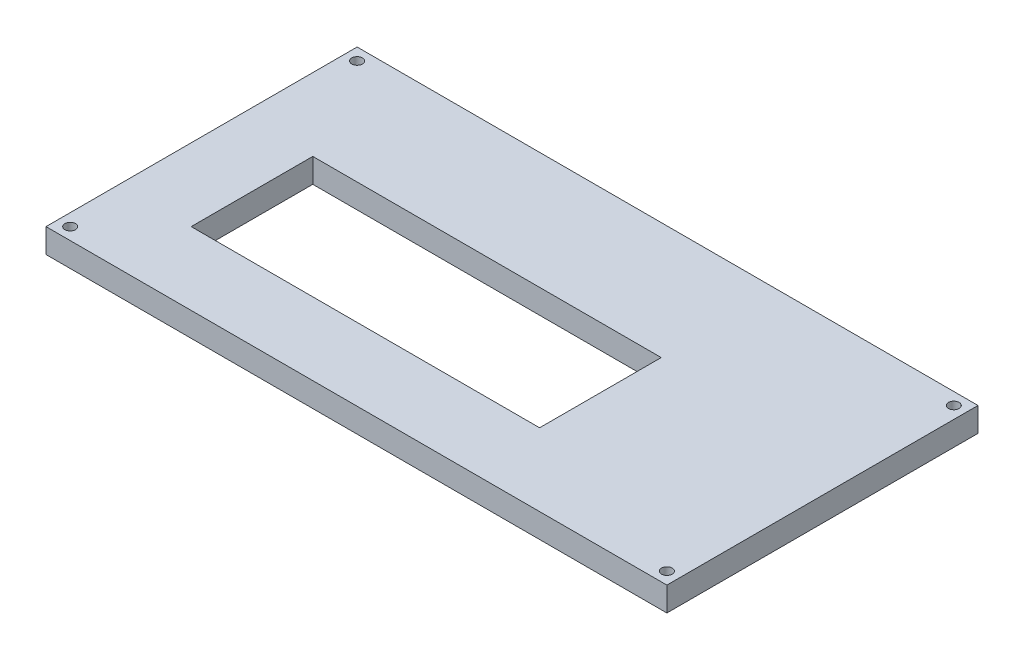
ISO-10303-21;
HEADER;
FILE_DESCRIPTION(('STEP AP214'),'2;1');
FILE_NAME('part.step','',(''),(''),'','','');
FILE_SCHEMA(('AUTOMOTIVE_DESIGN { 1 0 10303 214 1 1 1 1 }'));
ENDSEC;
DATA;
#1=APPLICATION_CONTEXT('core data for automotive mechanical design processes');
#2=APPLICATION_PROTOCOL_DEFINITION('international standard','automotive_design',2000,#1);
#3=PRODUCT_CONTEXT('',#1,'mechanical');
#4=PRODUCT('Part','Part','',(#3));
#5=PRODUCT_RELATED_PRODUCT_CATEGORY('part','',(#4));
#6=PRODUCT_DEFINITION_FORMATION('','',#4);
#7=PRODUCT_DEFINITION_CONTEXT('part definition',#1,'design');
#8=PRODUCT_DEFINITION('design','',#6,#7);
#9=PRODUCT_DEFINITION_SHAPE('','',#8);
#10=(LENGTH_UNIT() NAMED_UNIT(*) SI_UNIT(.MILLI.,.METRE.));
#11=(NAMED_UNIT(*) PLANE_ANGLE_UNIT() SI_UNIT($,.RADIAN.));
#12=(NAMED_UNIT(*) SI_UNIT($,.STERADIAN.) SOLID_ANGLE_UNIT());
#13=UNCERTAINTY_MEASURE_WITH_UNIT(LENGTH_MEASURE(1.E-05),#10,'distance_accuracy_value','');
#14=(GEOMETRIC_REPRESENTATION_CONTEXT(3) GLOBAL_UNCERTAINTY_ASSIGNED_CONTEXT((#13)) GLOBAL_UNIT_ASSIGNED_CONTEXT((#10,
#11,#12)) REPRESENTATION_CONTEXT('',''));
#15=CARTESIAN_POINT('',(0.,0.,0.));
#16=DIRECTION('',(0.,0.,1.));
#17=DIRECTION('',(1.,0.,0.));
#18=AXIS2_PLACEMENT_3D('',#15,#16,#17);
#19=CARTESIAN_POINT('',(0.,5.,-64.29));
#20=DIRECTION('',(-1.,0.,0.));
#21=DIRECTION('',(0.,0.,1.));
#22=AXIS2_PLACEMENT_3D('',#19,#20,#21);
#23=PLANE('',#22);
#24=DIRECTION('',(0.,0.,-1.));
#25=VECTOR('',#24,1.);
#26=CARTESIAN_POINT('',(0.,0.,-64.29));
#27=LINE('',#26,#25);
#28=CARTESIAN_POINT('',(0.,0.,0.));
#29=VERTEX_POINT('',#28);
#30=CARTESIAN_POINT('',(0.,0.,-64.29));
#31=VERTEX_POINT('',#30);
#32=EDGE_CURVE('E157',#29,#31,#27,.T.);
#33=ORIENTED_EDGE('',*,*,#32,.T.);
#34=DIRECTION('',(0.,-1.,0.));
#35=VECTOR('',#34,1.);
#36=CARTESIAN_POINT('',(0.,5.,-64.29));
#37=LINE('',#36,#35);
#38=CARTESIAN_POINT('',(0.,5.,-64.29));
#39=VERTEX_POINT('',#38);
#40=EDGE_CURVE('E11',#39,#31,#37,.T.);
#41=ORIENTED_EDGE('',*,*,#40,.F.);
#42=DIRECTION('',(0.,0.,-1.));
#43=VECTOR('',#42,1.);
#44=CARTESIAN_POINT('',(0.,5.,-64.29));
#45=LINE('',#44,#43);
#46=CARTESIAN_POINT('',(0.,5.,0.));
#47=VERTEX_POINT('',#46);
#48=EDGE_CURVE('E160',#47,#39,#45,.T.);
#49=ORIENTED_EDGE('',*,*,#48,.F.);
#50=DIRECTION('',(0.,-1.,0.));
#51=VECTOR('',#50,1.);
#52=CARTESIAN_POINT('',(0.,5.,0.));
#53=LINE('',#52,#51);
#54=EDGE_CURVE('E170',#47,#29,#53,.T.);
#55=ORIENTED_EDGE('',*,*,#54,.T.);
#56=EDGE_LOOP('',(#33,#41,#49,#55));
#57=FACE_BOUND('',#56,.T.);
#58=ADVANCED_FACE('F35',(#57),#23,.F.);
#59=CARTESIAN_POINT('',(-128.3,5.,-64.29));
#60=DIRECTION('',(0.,0.,1.));
#61=DIRECTION('',(1.,0.,0.));
#62=AXIS2_PLACEMENT_3D('',#59,#60,#61);
#63=PLANE('',#62);
#64=DIRECTION('',(-1.,0.,0.));
#65=VECTOR('',#64,1.);
#66=CARTESIAN_POINT('',(-128.3,0.,-64.29));
#67=LINE('',#66,#65);
#68=CARTESIAN_POINT('',(-128.3,0.,-64.29));
#69=VERTEX_POINT('',#68);
#70=EDGE_CURVE('E173',#31,#69,#67,.T.);
#71=ORIENTED_EDGE('',*,*,#70,.T.);
#72=DIRECTION('',(0.,-1.,0.));
#73=VECTOR('',#72,1.);
#74=CARTESIAN_POINT('',(-128.3,5.,-64.29));
#75=LINE('',#74,#73);
#76=CARTESIAN_POINT('',(-128.3,5.,-64.29));
#77=VERTEX_POINT('',#76);
#78=EDGE_CURVE('E42',#77,#69,#75,.T.);
#79=ORIENTED_EDGE('',*,*,#78,.F.);
#80=DIRECTION('',(-1.,0.,0.));
#81=VECTOR('',#80,1.);
#82=CARTESIAN_POINT('',(-128.3,5.,-64.29));
#83=LINE('',#82,#81);
#84=EDGE_CURVE('E163',#39,#77,#83,.T.);
#85=ORIENTED_EDGE('',*,*,#84,.F.);
#86=ORIENTED_EDGE('',*,*,#40,.T.);
#87=EDGE_LOOP('',(#71,#79,#85,#86));
#88=FACE_BOUND('',#87,.T.);
#89=ADVANCED_FACE('F202',(#88),#63,.F.);
#90=CARTESIAN_POINT('',(-128.3,5.,0.));
#91=DIRECTION('',(1.,0.,0.));
#92=DIRECTION('',(0.,0.,-1.));
#93=AXIS2_PLACEMENT_3D('',#90,#91,#92);
#94=PLANE('',#93);
#95=DIRECTION('',(0.,0.,1.));
#96=VECTOR('',#95,1.);
#97=CARTESIAN_POINT('',(-128.3,0.,0.));
#98=LINE('',#97,#96);
#99=CARTESIAN_POINT('',(-128.3,0.,0.));
#100=VERTEX_POINT('',#99);
#101=EDGE_CURVE('E175',#69,#100,#98,.T.);
#102=ORIENTED_EDGE('',*,*,#101,.T.);
#103=DIRECTION('',(0.,-1.,0.));
#104=VECTOR('',#103,1.);
#105=CARTESIAN_POINT('',(-128.3,5.,0.));
#106=LINE('',#105,#104);
#107=CARTESIAN_POINT('',(-128.3,5.,0.));
#108=VERTEX_POINT('',#107);
#109=EDGE_CURVE('E180',#108,#100,#106,.T.);
#110=ORIENTED_EDGE('',*,*,#109,.F.);
#111=DIRECTION('',(0.,0.,1.));
#112=VECTOR('',#111,1.);
#113=CARTESIAN_POINT('',(-128.3,5.,0.));
#114=LINE('',#113,#112);
#115=EDGE_CURVE('E166',#77,#108,#114,.T.);
#116=ORIENTED_EDGE('',*,*,#115,.F.);
#117=ORIENTED_EDGE('',*,*,#78,.T.);
#118=EDGE_LOOP('',(#102,#110,#116,#117));
#119=FACE_BOUND('',#118,.T.);
#120=ADVANCED_FACE('F187',(#119),#94,.F.);
#121=CARTESIAN_POINT('',(0.,5.,0.));
#122=DIRECTION('',(0.,0.,-1.));
#123=DIRECTION('',(-1.,0.,0.));
#124=AXIS2_PLACEMENT_3D('',#121,#122,#123);
#125=PLANE('',#124);
#126=DIRECTION('',(1.,0.,0.));
#127=VECTOR('',#126,1.);
#128=CARTESIAN_POINT('',(0.,0.,0.));
#129=LINE('',#128,#127);
#130=EDGE_CURVE('E164',#100,#29,#129,.T.);
#131=ORIENTED_EDGE('',*,*,#130,.T.);
#132=ORIENTED_EDGE('',*,*,#54,.F.);
#133=DIRECTION('',(1.,0.,0.));
#134=VECTOR('',#133,1.);
#135=CARTESIAN_POINT('',(0.,5.,0.));
#136=LINE('',#135,#134);
#137=EDGE_CURVE('E168',#108,#47,#136,.T.);
#138=ORIENTED_EDGE('',*,*,#137,.F.);
#139=ORIENTED_EDGE('',*,*,#109,.T.);
#140=EDGE_LOOP('',(#131,#132,#138,#139));
#141=FACE_BOUND('',#140,.T.);
#142=ADVANCED_FACE('F196',(#141),#125,.F.);
#143=CARTESIAN_POINT('',(0.,5.,0.));
#144=DIRECTION('',(0.,-1.,0.));
#145=DIRECTION('',(0.,0.,-1.));
#146=AXIS2_PLACEMENT_3D('',#143,#144,#145);
#147=PLANE('',#146);
#148=DIRECTION('',(0.,0.,1.));
#149=VECTOR('',#148,1.);
#150=CARTESIAN_POINT('',(-41.3,5.,-40.13));
#151=LINE('',#150,#149);
#152=CARTESIAN_POINT('',(-41.3,5.,-40.13));
#153=VERTEX_POINT('',#152);
#154=CARTESIAN_POINT('',(-41.3,5.,-15.));
#155=VERTEX_POINT('',#154);
#156=EDGE_CURVE('E107',#153,#155,#151,.T.);
#157=ORIENTED_EDGE('',*,*,#156,.T.);
#158=DIRECTION('',(-1.,0.,0.));
#159=VECTOR('',#158,1.);
#160=CARTESIAN_POINT('',(-41.3,5.,-15.));
#161=LINE('',#160,#159);
#162=CARTESIAN_POINT('',(-113.3,5.,-15.));
#163=VERTEX_POINT('',#162);
#164=EDGE_CURVE('E101',#155,#163,#161,.T.);
#165=ORIENTED_EDGE('',*,*,#164,.T.);
#166=DIRECTION('',(0.,0.,-1.));
#167=VECTOR('',#166,1.);
#168=CARTESIAN_POINT('',(-113.3,5.,-15.));
#169=LINE('',#168,#167);
#170=CARTESIAN_POINT('',(-113.3,5.,-40.13));
#171=VERTEX_POINT('',#170);
#172=EDGE_CURVE('E110',#163,#171,#169,.T.);
#173=ORIENTED_EDGE('',*,*,#172,.T.);
#174=DIRECTION('',(1.,0.,0.));
#175=VECTOR('',#174,1.);
#176=CARTESIAN_POINT('',(-113.3,5.,-40.13));
#177=LINE('',#176,#175);
#178=EDGE_CURVE('E49',#171,#153,#177,.T.);
#179=ORIENTED_EDGE('',*,*,#178,.T.);
#180=EDGE_LOOP('',(#157,#165,#173,#179));
#181=FACE_BOUND('',#180,.T.);
#182=CARTESIAN_POINT('',(-125.8,5.,-61.79));
#183=DIRECTION('',(0.,-1.,0.));
#184=DIRECTION('',(0.,0.,-1.));
#185=AXIS2_PLACEMENT_3D('',#182,#183,#184);
#186=CIRCLE('',#185,1.10000000000002);
#187=CARTESIAN_POINT('',(-125.8,5.,-62.89));
#188=VERTEX_POINT('',#187);
#189=EDGE_CURVE('E142',#188,#188,#186,.T.);
#190=ORIENTED_EDGE('',*,*,#189,.T.);
#191=EDGE_LOOP('',(#190));
#192=FACE_BOUND('',#191,.T.);
#193=CARTESIAN_POINT('',(-2.5,5.,-2.5));
#194=DIRECTION('',(0.,-1.,0.));
#195=DIRECTION('',(0.,0.,-1.));
#196=AXIS2_PLACEMENT_3D('',#193,#194,#195);
#197=CIRCLE('',#196,1.1);
#198=CARTESIAN_POINT('',(-2.5,5.,-3.6));
#199=VERTEX_POINT('',#198);
#200=EDGE_CURVE('E149',#199,#199,#197,.T.);
#201=ORIENTED_EDGE('',*,*,#200,.T.);
#202=EDGE_LOOP('',(#201));
#203=FACE_BOUND('',#202,.T.);
#204=CARTESIAN_POINT('',(-2.49999999999999,5.,-61.79));
#205=DIRECTION('',(0.,-1.,0.));
#206=DIRECTION('',(0.,0.,-1.));
#207=AXIS2_PLACEMENT_3D('',#204,#205,#206);
#208=CIRCLE('',#207,1.1);
#209=CARTESIAN_POINT('',(-2.49999999999999,5.,-62.89));
#210=VERTEX_POINT('',#209);
#211=EDGE_CURVE('E136',#210,#210,#208,.T.);
#212=ORIENTED_EDGE('',*,*,#211,.T.);
#213=EDGE_LOOP('',(#212));
#214=FACE_BOUND('',#213,.T.);
#215=CARTESIAN_POINT('',(-125.8,5.,-2.5));
#216=DIRECTION('',(0.,-1.,0.));
#217=DIRECTION('',(0.,0.,-1.));
#218=AXIS2_PLACEMENT_3D('',#215,#216,#217);
#219=CIRCLE('',#218,1.10000000000002);
#220=CARTESIAN_POINT('',(-125.8,5.,-3.60000000000002));
#221=VERTEX_POINT('',#220);
#222=EDGE_CURVE('E154',#221,#221,#219,.T.);
#223=ORIENTED_EDGE('',*,*,#222,.T.);
#224=EDGE_LOOP('',(#223));
#225=FACE_BOUND('',#224,.T.);
#226=ORIENTED_EDGE('',*,*,#48,.T.);
#227=ORIENTED_EDGE('',*,*,#84,.T.);
#228=ORIENTED_EDGE('',*,*,#115,.T.);
#229=ORIENTED_EDGE('',*,*,#137,.T.);
#230=EDGE_LOOP('',(#226,#227,#228,#229));
#231=FACE_BOUND('',#230,.T.);
#232=ADVANCED_FACE('F114',(#181,#192,#203,#214,#225,#231),#147,.F.);
#233=CARTESIAN_POINT('',(0.,0.,0.));
#234=DIRECTION('',(0.,-1.,0.));
#235=DIRECTION('',(0.,0.,-1.));
#236=AXIS2_PLACEMENT_3D('',#233,#234,#235);
#237=PLANE('',#236);
#238=DIRECTION('',(-1.,0.,0.));
#239=VECTOR('',#238,1.);
#240=CARTESIAN_POINT('',(-41.3,0.,-15.));
#241=LINE('',#240,#239);
#242=CARTESIAN_POINT('',(-41.3,0.,-15.));
#243=VERTEX_POINT('',#242);
#244=CARTESIAN_POINT('',(-113.3,0.,-15.));
#245=VERTEX_POINT('',#244);
#246=EDGE_CURVE('E57',#243,#245,#241,.T.);
#247=ORIENTED_EDGE('',*,*,#246,.F.);
#248=DIRECTION('',(0.,0.,1.));
#249=VECTOR('',#248,1.);
#250=CARTESIAN_POINT('',(-41.3,0.,-40.13));
#251=LINE('',#250,#249);
#252=CARTESIAN_POINT('',(-41.3,0.,-40.13));
#253=VERTEX_POINT('',#252);
#254=EDGE_CURVE('E117',#253,#243,#251,.T.);
#255=ORIENTED_EDGE('',*,*,#254,.F.);
#256=DIRECTION('',(1.,0.,0.));
#257=VECTOR('',#256,1.);
#258=CARTESIAN_POINT('',(-113.3,0.,-40.13));
#259=LINE('',#258,#257);
#260=CARTESIAN_POINT('',(-113.3,0.,-40.13));
#261=VERTEX_POINT('',#260);
#262=EDGE_CURVE('E120',#261,#253,#259,.T.);
#263=ORIENTED_EDGE('',*,*,#262,.F.);
#264=DIRECTION('',(0.,0.,-1.));
#265=VECTOR('',#264,1.);
#266=CARTESIAN_POINT('',(-113.3,0.,-15.));
#267=LINE('',#266,#265);
#268=EDGE_CURVE('E126',#245,#261,#267,.T.);
#269=ORIENTED_EDGE('',*,*,#268,.F.);
#270=EDGE_LOOP('',(#247,#255,#263,#269));
#271=FACE_BOUND('',#270,.T.);
#272=CARTESIAN_POINT('',(-125.8,0.,-61.79));
#273=DIRECTION('',(0.,-1.,0.));
#274=DIRECTION('',(0.,0.,-1.));
#275=AXIS2_PLACEMENT_3D('',#272,#273,#274);
#276=CIRCLE('',#275,1.10000000000002);
#277=CARTESIAN_POINT('',(-125.8,0.,-62.89));
#278=VERTEX_POINT('',#277);
#279=EDGE_CURVE('E146',#278,#278,#276,.T.);
#280=ORIENTED_EDGE('',*,*,#279,.F.);
#281=EDGE_LOOP('',(#280));
#282=FACE_BOUND('',#281,.T.);
#283=CARTESIAN_POINT('',(-2.5,0.,-2.5));
#284=DIRECTION('',(0.,-1.,0.));
#285=DIRECTION('',(0.,0.,-1.));
#286=AXIS2_PLACEMENT_3D('',#283,#284,#285);
#287=CIRCLE('',#286,1.1);
#288=CARTESIAN_POINT('',(-2.5,0.,-3.6));
#289=VERTEX_POINT('',#288);
#290=EDGE_CURVE('E139',#289,#289,#287,.T.);
#291=ORIENTED_EDGE('',*,*,#290,.F.);
#292=EDGE_LOOP('',(#291));
#293=FACE_BOUND('',#292,.T.);
#294=CARTESIAN_POINT('',(-2.49999999999999,0.,-61.79));
#295=DIRECTION('',(0.,-1.,0.));
#296=DIRECTION('',(0.,0.,-1.));
#297=AXIS2_PLACEMENT_3D('',#294,#295,#296);
#298=CIRCLE('',#297,1.1);
#299=CARTESIAN_POINT('',(-2.49999999999999,0.,-62.89));
#300=VERTEX_POINT('',#299);
#301=EDGE_CURVE('E132',#300,#300,#298,.T.);
#302=ORIENTED_EDGE('',*,*,#301,.F.);
#303=EDGE_LOOP('',(#302));
#304=FACE_BOUND('',#303,.T.);
#305=CARTESIAN_POINT('',(-125.8,0.,-2.5));
#306=DIRECTION('',(0.,-1.,0.));
#307=DIRECTION('',(0.,0.,-1.));
#308=AXIS2_PLACEMENT_3D('',#305,#306,#307);
#309=CIRCLE('',#308,1.10000000000002);
#310=CARTESIAN_POINT('',(-125.8,0.,-3.60000000000002));
#311=VERTEX_POINT('',#310);
#312=EDGE_CURVE('E145',#311,#311,#309,.T.);
#313=ORIENTED_EDGE('',*,*,#312,.F.);
#314=EDGE_LOOP('',(#313));
#315=FACE_BOUND('',#314,.T.);
#316=ORIENTED_EDGE('',*,*,#32,.F.);
#317=ORIENTED_EDGE('',*,*,#130,.F.);
#318=ORIENTED_EDGE('',*,*,#101,.F.);
#319=ORIENTED_EDGE('',*,*,#70,.F.);
#320=EDGE_LOOP('',(#316,#317,#318,#319));
#321=FACE_BOUND('',#320,.T.);
#322=ADVANCED_FACE('F193',(#271,#282,#293,#304,#315,#321),#237,.T.);
#323=CARTESIAN_POINT('',(-125.8,5.,-2.5));
#324=DIRECTION('',(0.,-1.,0.));
#325=DIRECTION('',(0.,0.,-1.));
#326=AXIS2_PLACEMENT_3D('',#323,#324,#325);
#327=CYLINDRICAL_SURFACE('',#326,1.10000000000002);
#328=ORIENTED_EDGE('',*,*,#222,.F.);
#329=EDGE_LOOP('',(#328));
#330=FACE_BOUND('',#329,.T.);
#331=ORIENTED_EDGE('',*,*,#312,.T.);
#332=EDGE_LOOP('',(#331));
#333=FACE_BOUND('',#332,.T.);
#334=ADVANCED_FACE('F214',(#330,#333),#327,.F.);
#335=CARTESIAN_POINT('',(-2.49999999999999,5.,-61.79));
#336=DIRECTION('',(0.,-1.,0.));
#337=DIRECTION('',(0.,0.,-1.));
#338=AXIS2_PLACEMENT_3D('',#335,#336,#337);
#339=CYLINDRICAL_SURFACE('',#338,1.1);
#340=ORIENTED_EDGE('',*,*,#211,.F.);
#341=EDGE_LOOP('',(#340));
#342=FACE_BOUND('',#341,.T.);
#343=ORIENTED_EDGE('',*,*,#301,.T.);
#344=EDGE_LOOP('',(#343));
#345=FACE_BOUND('',#344,.T.);
#346=ADVANCED_FACE('F220',(#342,#345),#339,.F.);
#347=CARTESIAN_POINT('',(-2.5,5.,-2.5));
#348=DIRECTION('',(0.,-1.,0.));
#349=DIRECTION('',(0.,0.,-1.));
#350=AXIS2_PLACEMENT_3D('',#347,#348,#349);
#351=CYLINDRICAL_SURFACE('',#350,1.1);
#352=ORIENTED_EDGE('',*,*,#200,.F.);
#353=EDGE_LOOP('',(#352));
#354=FACE_BOUND('',#353,.T.);
#355=ORIENTED_EDGE('',*,*,#290,.T.);
#356=EDGE_LOOP('',(#355));
#357=FACE_BOUND('',#356,.T.);
#358=ADVANCED_FACE('F222',(#354,#357),#351,.F.);
#359=CARTESIAN_POINT('',(-125.8,5.,-61.79));
#360=DIRECTION('',(0.,-1.,0.));
#361=DIRECTION('',(0.,0.,-1.));
#362=AXIS2_PLACEMENT_3D('',#359,#360,#361);
#363=CYLINDRICAL_SURFACE('',#362,1.10000000000002);
#364=ORIENTED_EDGE('',*,*,#189,.F.);
#365=EDGE_LOOP('',(#364));
#366=FACE_BOUND('',#365,.T.);
#367=ORIENTED_EDGE('',*,*,#279,.T.);
#368=EDGE_LOOP('',(#367));
#369=FACE_BOUND('',#368,.T.);
#370=ADVANCED_FACE('F225',(#366,#369),#363,.F.);
#371=CARTESIAN_POINT('',(-41.3,5.,-15.));
#372=DIRECTION('',(0.,0.,1.));
#373=DIRECTION('',(1.,0.,0.));
#374=AXIS2_PLACEMENT_3D('',#371,#372,#373);
#375=PLANE('',#374);
#376=ORIENTED_EDGE('',*,*,#246,.T.);
#377=DIRECTION('',(0.,-1.,0.));
#378=VECTOR('',#377,1.);
#379=CARTESIAN_POINT('',(-113.3,5.,-15.));
#380=LINE('',#379,#378);
#381=EDGE_CURVE('E97',#163,#245,#380,.T.);
#382=ORIENTED_EDGE('',*,*,#381,.F.);
#383=ORIENTED_EDGE('',*,*,#164,.F.);
#384=DIRECTION('',(0.,-1.,0.));
#385=VECTOR('',#384,1.);
#386=CARTESIAN_POINT('',(-41.3,5.,-15.));
#387=LINE('',#386,#385);
#388=EDGE_CURVE('E130',#155,#243,#387,.T.);
#389=ORIENTED_EDGE('',*,*,#388,.T.);
#390=EDGE_LOOP('',(#376,#382,#383,#389));
#391=FACE_BOUND('',#390,.T.);
#392=ADVANCED_FACE('F99',(#391),#375,.F.);
#393=CARTESIAN_POINT('',(-41.3,5.,-40.13));
#394=DIRECTION('',(1.,0.,0.));
#395=DIRECTION('',(0.,0.,-1.));
#396=AXIS2_PLACEMENT_3D('',#393,#394,#395);
#397=PLANE('',#396);
#398=ORIENTED_EDGE('',*,*,#254,.T.);
#399=ORIENTED_EDGE('',*,*,#388,.F.);
#400=ORIENTED_EDGE('',*,*,#156,.F.);
#401=DIRECTION('',(0.,-1.,0.));
#402=VECTOR('',#401,1.);
#403=CARTESIAN_POINT('',(-41.3,5.,-40.13));
#404=LINE('',#403,#402);
#405=EDGE_CURVE('E133',#153,#253,#404,.T.);
#406=ORIENTED_EDGE('',*,*,#405,.T.);
#407=EDGE_LOOP('',(#398,#399,#400,#406));
#408=FACE_BOUND('',#407,.T.);
#409=ADVANCED_FACE('F235',(#408),#397,.F.);
#410=CARTESIAN_POINT('',(-113.3,5.,-40.13));
#411=DIRECTION('',(0.,0.,-1.));
#412=DIRECTION('',(-1.,0.,0.));
#413=AXIS2_PLACEMENT_3D('',#410,#411,#412);
#414=PLANE('',#413);
#415=ORIENTED_EDGE('',*,*,#262,.T.);
#416=ORIENTED_EDGE('',*,*,#405,.F.);
#417=ORIENTED_EDGE('',*,*,#178,.F.);
#418=DIRECTION('',(0.,-1.,0.));
#419=VECTOR('',#418,1.);
#420=CARTESIAN_POINT('',(-113.3,5.,-40.13));
#421=LINE('',#420,#419);
#422=EDGE_CURVE('E106',#171,#261,#421,.T.);
#423=ORIENTED_EDGE('',*,*,#422,.T.);
#424=EDGE_LOOP('',(#415,#416,#417,#423));
#425=FACE_BOUND('',#424,.T.);
#426=ADVANCED_FACE('F238',(#425),#414,.F.);
#427=CARTESIAN_POINT('',(-113.3,5.,-15.));
#428=DIRECTION('',(-1.,0.,0.));
#429=DIRECTION('',(0.,0.,1.));
#430=AXIS2_PLACEMENT_3D('',#427,#428,#429);
#431=PLANE('',#430);
#432=ORIENTED_EDGE('',*,*,#268,.T.);
#433=ORIENTED_EDGE('',*,*,#422,.F.);
#434=ORIENTED_EDGE('',*,*,#172,.F.);
#435=ORIENTED_EDGE('',*,*,#381,.T.);
#436=EDGE_LOOP('',(#432,#433,#434,#435));
#437=FACE_BOUND('',#436,.T.);
#438=ADVANCED_FACE('F111',(#437),#431,.F.);
#439=CLOSED_SHELL('',(#58,#89,#120,#142,#232,#322,#334,#346,#358,#370,#392,#409,#426,#438));
#440=MANIFOLD_SOLID_BREP('B2',#439);
#441=ADVANCED_BREP_SHAPE_REPRESENTATION('',(#18,#440),#14);
#442=SHAPE_DEFINITION_REPRESENTATION(#9,#441);
ENDSEC;
END-ISO-10303-21;
